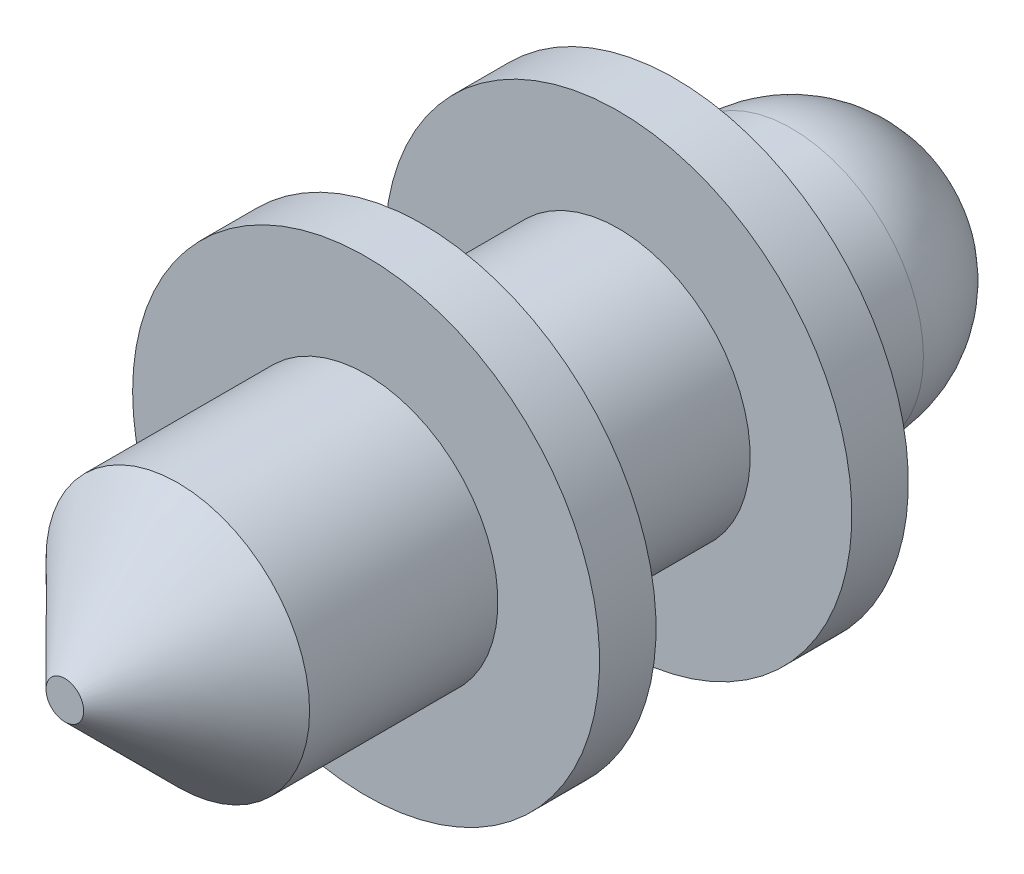
ISO-10303-21;
HEADER;
FILE_DESCRIPTION(('STEP AP214'),'2;1');
FILE_NAME('part.step','',(''),(''),'','','');
FILE_SCHEMA(('AUTOMOTIVE_DESIGN { 1 0 10303 214 1 1 1 1 }'));
ENDSEC;
DATA;
#1=APPLICATION_CONTEXT('core data for automotive mechanical design processes');
#2=APPLICATION_PROTOCOL_DEFINITION('international standard','automotive_design',2000,#1);
#3=PRODUCT_CONTEXT('',#1,'mechanical');
#4=PRODUCT('Part','Part','',(#3));
#5=PRODUCT_RELATED_PRODUCT_CATEGORY('part','',(#4));
#6=PRODUCT_DEFINITION_FORMATION('','',#4);
#7=PRODUCT_DEFINITION_CONTEXT('part definition',#1,'design');
#8=PRODUCT_DEFINITION('design','',#6,#7);
#9=PRODUCT_DEFINITION_SHAPE('','',#8);
#10=(LENGTH_UNIT() NAMED_UNIT(*) SI_UNIT(.MILLI.,.METRE.));
#11=(NAMED_UNIT(*) PLANE_ANGLE_UNIT() SI_UNIT($,.RADIAN.));
#12=(NAMED_UNIT(*) SI_UNIT($,.STERADIAN.) SOLID_ANGLE_UNIT());
#13=UNCERTAINTY_MEASURE_WITH_UNIT(LENGTH_MEASURE(1.E-05),#10,'distance_accuracy_value','');
#14=(GEOMETRIC_REPRESENTATION_CONTEXT(3) GLOBAL_UNCERTAINTY_ASSIGNED_CONTEXT((#13)) GLOBAL_UNIT_ASSIGNED_CONTEXT((#10,
#11,#12)) REPRESENTATION_CONTEXT('',''));
#15=CARTESIAN_POINT('',(0.,0.,0.));
#16=DIRECTION('',(0.,0.,1.));
#17=DIRECTION('',(1.,0.,0.));
#18=AXIS2_PLACEMENT_3D('',#15,#16,#17);
#19=CARTESIAN_POINT('',(0.,0.,-4.1));
#20=DIRECTION('',(0.,0.,-1.));
#21=DIRECTION('',(-1.,0.,0.));
#22=AXIS2_PLACEMENT_3D('',#19,#20,#21);
#23=PLANE('',#22);
#24=CARTESIAN_POINT('',(0.,0.,-4.1));
#25=DIRECTION('',(0.,0.,-1.));
#26=DIRECTION('',(-1.,0.,0.));
#27=AXIS2_PLACEMENT_3D('',#24,#25,#26);
#28=CIRCLE('',#27,3.1);
#29=CARTESIAN_POINT('',(-3.1,0.,-4.1));
#30=VERTEX_POINT('',#29);
#31=EDGE_CURVE('E59',#30,#30,#28,.T.);
#32=ORIENTED_EDGE('',*,*,#31,.T.);
#33=EDGE_LOOP('',(#32));
#34=FACE_BOUND('',#33,.T.);
#35=CARTESIAN_POINT('',(0.,0.,-4.1));
#36=DIRECTION('',(0.,0.,-1.));
#37=DIRECTION('',(-1.,0.,0.));
#38=AXIS2_PLACEMENT_3D('',#35,#36,#37);
#39=CIRCLE('',#38,1.75);
#40=CARTESIAN_POINT('',(-1.75,0.,-4.1));
#41=VERTEX_POINT('',#40);
#42=EDGE_CURVE('E65',#41,#41,#39,.T.);
#43=ORIENTED_EDGE('',*,*,#42,.F.);
#44=EDGE_LOOP('',(#43));
#45=FACE_BOUND('',#44,.T.);
#46=ADVANCED_FACE('F29',(#34,#45),#23,.T.);
#47=CARTESIAN_POINT('',(0.,0.,-0.75));
#48=DIRECTION('',(0.,0.,-1.));
#49=DIRECTION('',(-1.,0.,0.));
#50=AXIS2_PLACEMENT_3D('',#47,#48,#49);
#51=PLANE('',#50);
#52=CARTESIAN_POINT('',(0.,0.,-0.75));
#53=DIRECTION('',(0.,0.,-1.));
#54=DIRECTION('',(-1.,0.,0.));
#55=AXIS2_PLACEMENT_3D('',#52,#53,#54);
#56=CIRCLE('',#55,3.1);
#57=CARTESIAN_POINT('',(-3.1,0.,-0.75));
#58=VERTEX_POINT('',#57);
#59=EDGE_CURVE('E49',#58,#58,#56,.T.);
#60=ORIENTED_EDGE('',*,*,#59,.T.);
#61=EDGE_LOOP('',(#60));
#62=FACE_BOUND('',#61,.T.);
#63=CARTESIAN_POINT('',(0.,0.,-0.75));
#64=DIRECTION('',(0.,0.,-1.));
#65=DIRECTION('',(-1.,0.,0.));
#66=AXIS2_PLACEMENT_3D('',#63,#64,#65);
#67=CIRCLE('',#66,1.75);
#68=CARTESIAN_POINT('',(-1.75,0.,-0.75));
#69=VERTEX_POINT('',#68);
#70=EDGE_CURVE('E56',#69,#69,#67,.T.);
#71=ORIENTED_EDGE('',*,*,#70,.F.);
#72=EDGE_LOOP('',(#71));
#73=FACE_BOUND('',#72,.T.);
#74=ADVANCED_FACE('F74',(#62,#73),#51,.T.);
#75=CARTESIAN_POINT('',(0.,0.,4.));
#76=DIRECTION('',(0.,0.,-1.));
#77=DIRECTION('',(-1.,0.,0.));
#78=AXIS2_PLACEMENT_3D('',#75,#76,#77);
#79=CYLINDRICAL_SURFACE('',#78,1.75);
#80=CARTESIAN_POINT('',(0.,0.,2.5));
#81=DIRECTION('',(0.,0.,1.));
#82=DIRECTION('',(1.,0.,0.));
#83=AXIS2_PLACEMENT_3D('',#80,#81,#82);
#84=CIRCLE('',#83,1.75);
#85=CARTESIAN_POINT('',(1.75,0.,2.5));
#86=VERTEX_POINT('',#85);
#87=EDGE_CURVE('E36',#86,#86,#84,.F.);
#88=ORIENTED_EDGE('',*,*,#87,.T.);
#89=EDGE_LOOP('',(#88));
#90=FACE_BOUND('',#89,.T.);
#91=CARTESIAN_POINT('',(0.,0.,0.));
#92=DIRECTION('',(0.,0.,-1.));
#93=DIRECTION('',(-1.,0.,0.));
#94=AXIS2_PLACEMENT_3D('',#91,#92,#93);
#95=CIRCLE('',#94,1.75);
#96=CARTESIAN_POINT('',(-1.75,0.,0.));
#97=VERTEX_POINT('',#96);
#98=EDGE_CURVE('E44',#97,#97,#95,.T.);
#99=ORIENTED_EDGE('',*,*,#98,.F.);
#100=EDGE_LOOP('',(#99));
#101=FACE_BOUND('',#100,.T.);
#102=ADVANCED_FACE('F80',(#90,#101),#79,.T.);
#103=CARTESIAN_POINT('',(0.,0.,4.));
#104=DIRECTION('',(0.,0.,1.));
#105=DIRECTION('',(1.,0.,0.));
#106=AXIS2_PLACEMENT_3D('',#103,#104,#105);
#107=PLANE('',#106);
#108=CARTESIAN_POINT('',(0.,0.,4.));
#109=DIRECTION('',(0.,0.,1.));
#110=DIRECTION('',(1.,0.,0.));
#111=AXIS2_PLACEMENT_3D('',#108,#109,#110);
#112=CIRCLE('',#111,0.25);
#113=CARTESIAN_POINT('',(0.25,0.,4.));
#114=VERTEX_POINT('',#113);
#115=EDGE_CURVE('E40',#114,#114,#112,.T.);
#116=ORIENTED_EDGE('',*,*,#115,.T.);
#117=EDGE_LOOP('',(#116));
#118=FACE_BOUND('',#117,.T.);
#119=ADVANCED_FACE('F101',(#118),#107,.T.);
#120=CARTESIAN_POINT('',(0.,0.,0.));
#121=DIRECTION('',(0.,0.,-1.));
#122=DIRECTION('',(-1.,0.,0.));
#123=AXIS2_PLACEMENT_3D('',#120,#121,#122);
#124=PLANE('',#123);
#125=CARTESIAN_POINT('',(0.,0.,0.));
#126=DIRECTION('',(0.,0.,-1.));
#127=DIRECTION('',(-1.,0.,0.));
#128=AXIS2_PLACEMENT_3D('',#125,#126,#127);
#129=CIRCLE('',#128,3.1);
#130=CARTESIAN_POINT('',(-3.1,0.,0.));
#131=VERTEX_POINT('',#130);
#132=EDGE_CURVE('E50',#131,#131,#129,.T.);
#133=ORIENTED_EDGE('',*,*,#132,.F.);
#134=EDGE_LOOP('',(#133));
#135=FACE_BOUND('',#134,.T.);
#136=ORIENTED_EDGE('',*,*,#98,.T.);
#137=EDGE_LOOP('',(#136));
#138=FACE_BOUND('',#137,.T.);
#139=ADVANCED_FACE('F98',(#135,#138),#124,.F.);
#140=CARTESIAN_POINT('',(0.,0.,-0.75));
#141=DIRECTION('',(0.,0.,1.));
#142=DIRECTION('',(1.,0.,0.));
#143=AXIS2_PLACEMENT_3D('',#140,#141,#142);
#144=CYLINDRICAL_SURFACE('',#143,3.1);
#145=ORIENTED_EDGE('',*,*,#59,.F.);
#146=EDGE_LOOP('',(#145));
#147=FACE_BOUND('',#146,.T.);
#148=ORIENTED_EDGE('',*,*,#132,.T.);
#149=EDGE_LOOP('',(#148));
#150=FACE_BOUND('',#149,.T.);
#151=ADVANCED_FACE('F95',(#147,#150),#144,.T.);
#152=CARTESIAN_POINT('',(0.,0.,-3.35));
#153=DIRECTION('',(0.,0.,1.));
#154=DIRECTION('',(1.,0.,0.));
#155=AXIS2_PLACEMENT_3D('',#152,#153,#154);
#156=CYLINDRICAL_SURFACE('',#155,1.75);
#157=CARTESIAN_POINT('',(0.,0.,-3.35));
#158=DIRECTION('',(0.,0.,-1.));
#159=DIRECTION('',(-1.,0.,0.));
#160=AXIS2_PLACEMENT_3D('',#157,#158,#159);
#161=CIRCLE('',#160,1.75);
#162=CARTESIAN_POINT('',(-1.75,0.,-3.35));
#163=VERTEX_POINT('',#162);
#164=EDGE_CURVE('E53',#163,#163,#161,.T.);
#165=ORIENTED_EDGE('',*,*,#164,.F.);
#166=EDGE_LOOP('',(#165));
#167=FACE_BOUND('',#166,.T.);
#168=ORIENTED_EDGE('',*,*,#70,.T.);
#169=EDGE_LOOP('',(#168));
#170=FACE_BOUND('',#169,.T.);
#171=ADVANCED_FACE('F89',(#167,#170),#156,.T.);
#172=CARTESIAN_POINT('',(0.,0.,-3.35));
#173=DIRECTION('',(0.,0.,-1.));
#174=DIRECTION('',(-1.,0.,0.));
#175=AXIS2_PLACEMENT_3D('',#172,#173,#174);
#176=PLANE('',#175);
#177=CARTESIAN_POINT('',(0.,0.,-3.35));
#178=DIRECTION('',(0.,0.,-1.));
#179=DIRECTION('',(-1.,0.,0.));
#180=AXIS2_PLACEMENT_3D('',#177,#178,#179);
#181=CIRCLE('',#180,3.1);
#182=CARTESIAN_POINT('',(-3.1,0.,-3.35));
#183=VERTEX_POINT('',#182);
#184=EDGE_CURVE('E62',#183,#183,#181,.T.);
#185=ORIENTED_EDGE('',*,*,#184,.F.);
#186=EDGE_LOOP('',(#185));
#187=FACE_BOUND('',#186,.T.);
#188=ORIENTED_EDGE('',*,*,#164,.T.);
#189=EDGE_LOOP('',(#188));
#190=FACE_BOUND('',#189,.T.);
#191=ADVANCED_FACE('F85',(#187,#190),#176,.F.);
#192=CARTESIAN_POINT('',(0.,0.,-4.1));
#193=DIRECTION('',(0.,0.,1.));
#194=DIRECTION('',(1.,0.,0.));
#195=AXIS2_PLACEMENT_3D('',#192,#193,#194);
#196=CYLINDRICAL_SURFACE('',#195,3.1);
#197=ORIENTED_EDGE('',*,*,#31,.F.);
#198=EDGE_LOOP('',(#197));
#199=FACE_BOUND('',#198,.T.);
#200=ORIENTED_EDGE('',*,*,#184,.T.);
#201=EDGE_LOOP('',(#200));
#202=FACE_BOUND('',#201,.T.);
#203=ADVANCED_FACE('F88',(#199,#202),#196,.T.);
#204=CARTESIAN_POINT('',(0.,0.,-7.4));
#205=DIRECTION('',(0.,0.,1.));
#206=DIRECTION('',(1.,0.,0.));
#207=AXIS2_PLACEMENT_3D('',#204,#205,#206);
#208=CYLINDRICAL_SURFACE('',#207,1.75);
#209=CARTESIAN_POINT('',(0.,0.,-5.65));
#210=DIRECTION('',(0.,0.,1.));
#211=DIRECTION('',(1.,0.,0.));
#212=AXIS2_PLACEMENT_3D('',#209,#210,#211);
#213=CIRCLE('',#212,1.75);
#214=CARTESIAN_POINT('',(1.75,0.,-5.65));
#215=VERTEX_POINT('',#214);
#216=EDGE_CURVE('E10',#215,#215,#213,.T.);
#217=ORIENTED_EDGE('',*,*,#216,.T.);
#218=EDGE_LOOP('',(#217));
#219=FACE_BOUND('',#218,.T.);
#220=ORIENTED_EDGE('',*,*,#42,.T.);
#221=EDGE_LOOP('',(#220));
#222=FACE_BOUND('',#221,.T.);
#223=ADVANCED_FACE('F71',(#219,#222),#208,.T.);
#224=CARTESIAN_POINT('',(0.,0.,4.));
#225=DIRECTION('',(0.,0.,-1.));
#226=DIRECTION('',(-1.,0.,0.));
#227=AXIS2_PLACEMENT_3D('',#224,#225,#226);
#228=CONICAL_SURFACE('',#227,0.25,0.785398163397447);
#229=ORIENTED_EDGE('',*,*,#87,.F.);
#230=EDGE_LOOP('',(#229));
#231=FACE_BOUND('',#230,.T.);
#232=ORIENTED_EDGE('',*,*,#115,.F.);
#233=EDGE_LOOP('',(#232));
#234=FACE_BOUND('',#233,.T.);
#235=ADVANCED_FACE('F110',(#231,#234),#228,.T.);
#236=CARTESIAN_POINT('',(0.,0.,-5.65));
#237=DIRECTION('',(0.,0.,1.));
#238=DIRECTION('',(1.,0.,0.));
#239=AXIS2_PLACEMENT_3D('',#236,#237,#238);
#240=SPHERICAL_SURFACE('',#239,1.75);
#241=ORIENTED_EDGE('',*,*,#216,.F.);
#242=EDGE_LOOP('',(#241));
#243=FACE_BOUND('',#242,.T.);
#244=ADVANCED_FACE('F31',(#243),#240,.T.);
#245=CLOSED_SHELL('',(#46,#74,#102,#119,#139,#151,#171,#191,#203,#223,#235,#244));
#246=MANIFOLD_SOLID_BREP('B2',#245);
#247=ADVANCED_BREP_SHAPE_REPRESENTATION('',(#18,#246),#14);
#248=SHAPE_DEFINITION_REPRESENTATION(#9,#247);
ENDSEC;
END-ISO-10303-21;
